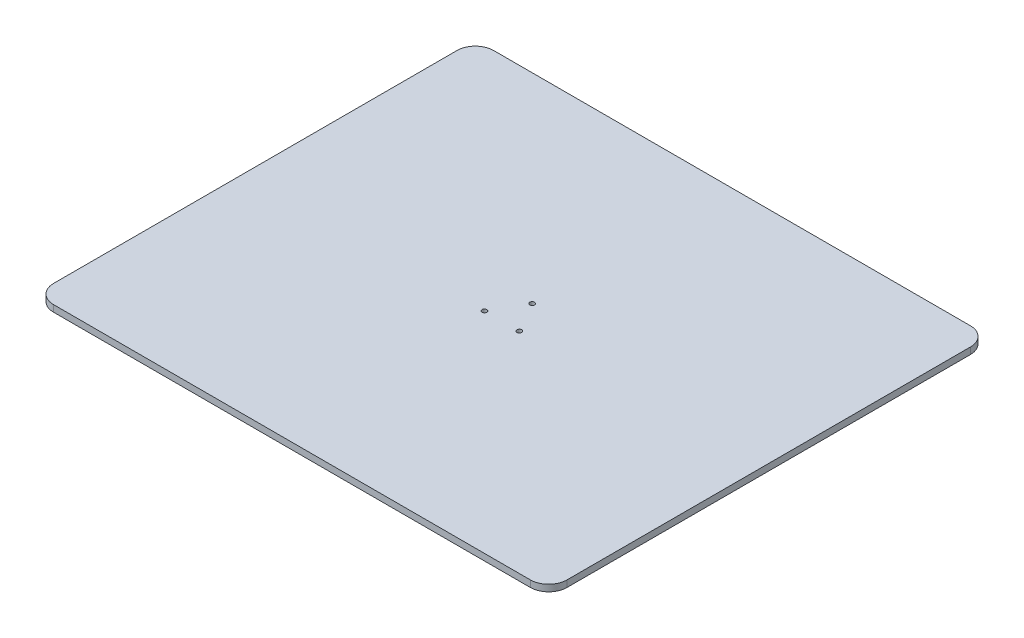
ISO-10303-21;
HEADER;
FILE_DESCRIPTION(('STEP AP214'),'2;1');
FILE_NAME('part.step','',(''),(''),'','','');
FILE_SCHEMA(('AUTOMOTIVE_DESIGN { 1 0 10303 214 1 1 1 1 }'));
ENDSEC;
DATA;
#1=APPLICATION_CONTEXT('core data for automotive mechanical design processes');
#2=APPLICATION_PROTOCOL_DEFINITION('international standard','automotive_design',2000,#1);
#3=PRODUCT_CONTEXT('',#1,'mechanical');
#4=PRODUCT('Part','Part','',(#3));
#5=PRODUCT_RELATED_PRODUCT_CATEGORY('part','',(#4));
#6=PRODUCT_DEFINITION_FORMATION('','',#4);
#7=PRODUCT_DEFINITION_CONTEXT('part definition',#1,'design');
#8=PRODUCT_DEFINITION('design','',#6,#7);
#9=PRODUCT_DEFINITION_SHAPE('','',#8);
#10=(LENGTH_UNIT() NAMED_UNIT(*) SI_UNIT(.MILLI.,.METRE.));
#11=(NAMED_UNIT(*) PLANE_ANGLE_UNIT() SI_UNIT($,.RADIAN.));
#12=(NAMED_UNIT(*) SI_UNIT($,.STERADIAN.) SOLID_ANGLE_UNIT());
#13=UNCERTAINTY_MEASURE_WITH_UNIT(LENGTH_MEASURE(1.E-05),#10,'distance_accuracy_value','');
#14=(GEOMETRIC_REPRESENTATION_CONTEXT(3) GLOBAL_UNCERTAINTY_ASSIGNED_CONTEXT((#13)) GLOBAL_UNIT_ASSIGNED_CONTEXT((#10,
#11,#12)) REPRESENTATION_CONTEXT('',''));
#15=CARTESIAN_POINT('',(0.,0.,0.));
#16=DIRECTION('',(0.,0.,1.));
#17=DIRECTION('',(1.,0.,0.));
#18=AXIS2_PLACEMENT_3D('',#15,#16,#17);
#19=CARTESIAN_POINT('',(1.38777878078145E-13,-6.,0.));
#20=DIRECTION('',(0.,1.,0.));
#21=DIRECTION('',(0.,0.,1.));
#22=AXIS2_PLACEMENT_3D('',#19,#20,#21);
#23=CYLINDRICAL_SURFACE('',#22,75.);
#24=CARTESIAN_POINT('',(1.38777878078145E-13,-6.,0.));
#25=DIRECTION('',(0.,-1.,0.));
#26=DIRECTION('',(0.,0.,-1.));
#27=AXIS2_PLACEMENT_3D('',#24,#25,#26);
#28=CIRCLE('',#27,75.);
#29=CARTESIAN_POINT('',(1.38777878078145E-13,-6.,-75.));
#30=VERTEX_POINT('',#29);
#31=EDGE_CURVE('E11',#30,#30,#28,.T.);
#32=ORIENTED_EDGE('',*,*,#31,.F.);
#33=EDGE_LOOP('',(#32));
#34=FACE_BOUND('',#33,.T.);
#35=CARTESIAN_POINT('',(1.38777878078145E-13,0.,0.));
#36=DIRECTION('',(0.,-1.,0.));
#37=DIRECTION('',(0.,0.,-1.));
#38=AXIS2_PLACEMENT_3D('',#35,#36,#37);
#39=CIRCLE('',#38,75.);
#40=CARTESIAN_POINT('',(1.38777878078145E-13,0.,-75.));
#41=VERTEX_POINT('',#40);
#42=EDGE_CURVE('E48',#41,#41,#39,.T.);
#43=ORIENTED_EDGE('',*,*,#42,.T.);
#44=EDGE_LOOP('',(#43));
#45=FACE_BOUND('',#44,.T.);
#46=ADVANCED_FACE('F45',(#34,#45),#23,.T.);
#47=CARTESIAN_POINT('',(1.38777878078145E-13,-6.,0.));
#48=DIRECTION('',(0.,-1.,0.));
#49=DIRECTION('',(0.,0.,-1.));
#50=AXIS2_PLACEMENT_3D('',#47,#48,#49);
#51=PLANE('',#50);
#52=ORIENTED_EDGE('',*,*,#31,.T.);
#53=EDGE_LOOP('',(#52));
#54=FACE_BOUND('',#53,.T.);
#55=ADVANCED_FACE('F60',(#54),#51,.T.);
#56=CARTESIAN_POINT('',(1.38777878078145E-13,0.,0.));
#57=DIRECTION('',(0.,-1.,0.));
#58=DIRECTION('',(0.,0.,-1.));
#59=AXIS2_PLACEMENT_3D('',#56,#57,#58);
#60=PLANE('',#59);
#61=ORIENTED_EDGE('',*,*,#42,.F.);
#62=EDGE_LOOP('',(#61));
#63=FACE_BOUND('',#62,.T.);
#64=ADVANCED_FACE('F58',(#63),#60,.F.);
#65=CLOSED_SHELL('',(#46,#55,#64));
#66=MANIFOLD_SOLID_BREP('B2',#65);
#67=CARTESIAN_POINT('',(0.,18.,0.));
#68=DIRECTION('',(0.,1.,0.));
#69=DIRECTION('',(0.,0.,1.));
#70=AXIS2_PLACEMENT_3D('',#67,#68,#69);
#71=PLANE('',#70);
#72=CARTESIAN_POINT('',(-47.6313972081446,18.,27.5000000000033));
#73=DIRECTION('',(0.,1.,0.));
#74=DIRECTION('',(0.,0.,1.));
#75=AXIS2_PLACEMENT_3D('',#72,#73,#74);
#76=CIRCLE('',#75,6.49999999999991);
#77=CARTESIAN_POINT('',(-47.6313972081446,18.,34.0000000000032));
#78=VERTEX_POINT('',#77);
#79=EDGE_CURVE('E233',#78,#78,#76,.T.);
#80=ORIENTED_EDGE('',*,*,#79,.F.);
#81=EDGE_LOOP('',(#80));
#82=FACE_BOUND('',#81,.T.);
#83=DIRECTION('',(0.,0.,-1.));
#84=VECTOR('',#83,1.);
#85=CARTESIAN_POINT('',(700.,18.,-600.));
#86=LINE('',#85,#84);
#87=CARTESIAN_POINT('',(700.,18.,550.));
#88=VERTEX_POINT('',#87);
#89=CARTESIAN_POINT('',(700.,18.,-550.));
#90=VERTEX_POINT('',#89);
#91=EDGE_CURVE('E190',#88,#90,#86,.T.);
#92=ORIENTED_EDGE('',*,*,#91,.T.);
#93=CARTESIAN_POINT('',(650.,18.,-550.));
#94=DIRECTION('',(0.,1.,0.));
#95=DIRECTION('',(0.,0.,1.));
#96=AXIS2_PLACEMENT_3D('',#93,#94,#95);
#97=CIRCLE('',#96,50.);
#98=CARTESIAN_POINT('',(650.,18.,-600.));
#99=VERTEX_POINT('',#98);
#100=EDGE_CURVE('E205',#90,#99,#97,.T.);
#101=ORIENTED_EDGE('',*,*,#100,.T.);
#102=DIRECTION('',(-1.,0.,0.));
#103=VECTOR('',#102,1.);
#104=CARTESIAN_POINT('',(-700.,18.,-600.));
#105=LINE('',#104,#103);
#106=CARTESIAN_POINT('',(-650.,18.,-600.));
#107=VERTEX_POINT('',#106);
#108=EDGE_CURVE('E172',#99,#107,#105,.T.);
#109=ORIENTED_EDGE('',*,*,#108,.T.);
#110=CARTESIAN_POINT('',(-650.,18.,-550.));
#111=DIRECTION('',(0.,1.,0.));
#112=DIRECTION('',(0.,0.,1.));
#113=AXIS2_PLACEMENT_3D('',#110,#111,#112);
#114=CIRCLE('',#113,50.);
#115=CARTESIAN_POINT('',(-700.,18.,-550.));
#116=VERTEX_POINT('',#115);
#117=EDGE_CURVE('E200',#107,#116,#114,.T.);
#118=ORIENTED_EDGE('',*,*,#117,.T.);
#119=DIRECTION('',(0.,0.,1.));
#120=VECTOR('',#119,1.);
#121=CARTESIAN_POINT('',(-700.,18.,-600.));
#122=LINE('',#121,#120);
#123=CARTESIAN_POINT('',(-700.,18.,550.));
#124=VERTEX_POINT('',#123);
#125=EDGE_CURVE('E216',#116,#124,#122,.T.);
#126=ORIENTED_EDGE('',*,*,#125,.T.);
#127=CARTESIAN_POINT('',(-650.,18.,550.));
#128=DIRECTION('',(0.,1.,0.));
#129=DIRECTION('',(0.,0.,1.));
#130=AXIS2_PLACEMENT_3D('',#127,#128,#129);
#131=CIRCLE('',#130,50.);
#132=CARTESIAN_POINT('',(-650.,18.,600.));
#133=VERTEX_POINT('',#132);
#134=EDGE_CURVE('E108',#124,#133,#131,.T.);
#135=ORIENTED_EDGE('',*,*,#134,.T.);
#136=DIRECTION('',(1.,0.,0.));
#137=VECTOR('',#136,1.);
#138=CARTESIAN_POINT('',(-700.,18.,600.));
#139=LINE('',#138,#137);
#140=CARTESIAN_POINT('',(650.,18.,600.));
#141=VERTEX_POINT('',#140);
#142=EDGE_CURVE('E191',#133,#141,#139,.T.);
#143=ORIENTED_EDGE('',*,*,#142,.T.);
#144=CARTESIAN_POINT('',(650.,18.,550.));
#145=DIRECTION('',(0.,1.,0.));
#146=DIRECTION('',(0.,0.,1.));
#147=AXIS2_PLACEMENT_3D('',#144,#145,#146);
#148=CIRCLE('',#147,50.);
#149=EDGE_CURVE('E203',#141,#88,#148,.T.);
#150=ORIENTED_EDGE('',*,*,#149,.T.);
#151=EDGE_LOOP('',(#92,#101,#109,#118,#126,#135,#143,#150));
#152=FACE_BOUND('',#151,.T.);
#153=CARTESIAN_POINT('',(-7.68125894545489E-13,18.,-55.));
#154=DIRECTION('',(0.,1.,0.));
#155=DIRECTION('',(0.,0.,1.));
#156=AXIS2_PLACEMENT_3D('',#153,#154,#155);
#157=CIRCLE('',#156,6.49999999999991);
#158=CARTESIAN_POINT('',(-7.68125894545489E-13,18.,-48.5000000000001));
#159=VERTEX_POINT('',#158);
#160=EDGE_CURVE('E185',#159,#159,#157,.T.);
#161=ORIENTED_EDGE('',*,*,#160,.F.);
#162=EDGE_LOOP('',(#161));
#163=FACE_BOUND('',#162,.T.);
#164=CARTESIAN_POINT('',(47.6313972081454,18.,27.5000000000013));
#165=DIRECTION('',(0.,1.,0.));
#166=DIRECTION('',(0.,0.,1.));
#167=AXIS2_PLACEMENT_3D('',#164,#165,#166);
#168=CIRCLE('',#167,6.50000000000033);
#169=CARTESIAN_POINT('',(47.6313972081454,18.,34.0000000000017));
#170=VERTEX_POINT('',#169);
#171=EDGE_CURVE('E239',#170,#170,#168,.T.);
#172=ORIENTED_EDGE('',*,*,#171,.F.);
#173=EDGE_LOOP('',(#172));
#174=FACE_BOUND('',#173,.T.);
#175=ADVANCED_FACE('F86',(#82,#152,#163,#174),#71,.T.);
#176=CARTESIAN_POINT('',(0.,0.,0.));
#177=DIRECTION('',(0.,1.,0.));
#178=DIRECTION('',(0.,0.,1.));
#179=AXIS2_PLACEMENT_3D('',#176,#177,#178);
#180=PLANE('',#179);
#181=CARTESIAN_POINT('',(0.,0.,0.));
#182=DIRECTION('',(0.,-1.,0.));
#183=DIRECTION('',(0.,0.,-1.));
#184=AXIS2_PLACEMENT_3D('',#181,#182,#183);
#185=CIRCLE('',#184,5.);
#186=CARTESIAN_POINT('',(0.,0.,-5.));
#187=VERTEX_POINT('',#186);
#188=EDGE_CURVE('E248',#187,#187,#185,.T.);
#189=ORIENTED_EDGE('',*,*,#188,.F.);
#190=EDGE_LOOP('',(#189));
#191=FACE_BOUND('',#190,.T.);
#192=DIRECTION('',(-1.,0.,0.));
#193=VECTOR('',#192,1.);
#194=CARTESIAN_POINT('',(-700.,0.,-600.));
#195=LINE('',#194,#193);
#196=CARTESIAN_POINT('',(650.,0.,-600.));
#197=VERTEX_POINT('',#196);
#198=CARTESIAN_POINT('',(-650.,0.,-600.));
#199=VERTEX_POINT('',#198);
#200=EDGE_CURVE('E169',#197,#199,#195,.T.);
#201=ORIENTED_EDGE('',*,*,#200,.F.);
#202=CARTESIAN_POINT('',(650.,0.,-550.));
#203=DIRECTION('',(0.,1.,0.));
#204=DIRECTION('',(0.,0.,1.));
#205=AXIS2_PLACEMENT_3D('',#202,#203,#204);
#206=CIRCLE('',#205,50.);
#207=CARTESIAN_POINT('',(700.,0.,-550.));
#208=VERTEX_POINT('',#207);
#209=EDGE_CURVE('E152',#197,#208,#206,.F.);
#210=ORIENTED_EDGE('',*,*,#209,.T.);
#211=DIRECTION('',(0.,0.,-1.));
#212=VECTOR('',#211,1.);
#213=CARTESIAN_POINT('',(700.,0.,-600.));
#214=LINE('',#213,#212);
#215=CARTESIAN_POINT('',(700.,0.,550.));
#216=VERTEX_POINT('',#215);
#217=EDGE_CURVE('E180',#216,#208,#214,.T.);
#218=ORIENTED_EDGE('',*,*,#217,.F.);
#219=CARTESIAN_POINT('',(650.,0.,550.));
#220=DIRECTION('',(0.,1.,0.));
#221=DIRECTION('',(0.,0.,1.));
#222=AXIS2_PLACEMENT_3D('',#219,#220,#221);
#223=CIRCLE('',#222,50.);
#224=CARTESIAN_POINT('',(650.,0.,600.));
#225=VERTEX_POINT('',#224);
#226=EDGE_CURVE('E163',#216,#225,#223,.F.);
#227=ORIENTED_EDGE('',*,*,#226,.T.);
#228=DIRECTION('',(1.,0.,0.));
#229=VECTOR('',#228,1.);
#230=CARTESIAN_POINT('',(-700.,0.,600.));
#231=LINE('',#230,#229);
#232=CARTESIAN_POINT('',(-650.,0.,600.));
#233=VERTEX_POINT('',#232);
#234=EDGE_CURVE('E183',#233,#225,#231,.T.);
#235=ORIENTED_EDGE('',*,*,#234,.F.);
#236=CARTESIAN_POINT('',(-650.,0.,550.));
#237=DIRECTION('',(0.,1.,0.));
#238=DIRECTION('',(0.,0.,1.));
#239=AXIS2_PLACEMENT_3D('',#236,#237,#238);
#240=CIRCLE('',#239,50.);
#241=CARTESIAN_POINT('',(-700.,0.,550.));
#242=VERTEX_POINT('',#241);
#243=EDGE_CURVE('E194',#233,#242,#240,.F.);
#244=ORIENTED_EDGE('',*,*,#243,.T.);
#245=DIRECTION('',(0.,0.,1.));
#246=VECTOR('',#245,1.);
#247=CARTESIAN_POINT('',(-700.,0.,-600.));
#248=LINE('',#247,#246);
#249=CARTESIAN_POINT('',(-700.,0.,-550.));
#250=VERTEX_POINT('',#249);
#251=EDGE_CURVE('E179',#250,#242,#248,.T.);
#252=ORIENTED_EDGE('',*,*,#251,.F.);
#253=CARTESIAN_POINT('',(-650.,0.,-550.));
#254=DIRECTION('',(0.,1.,0.));
#255=DIRECTION('',(0.,0.,1.));
#256=AXIS2_PLACEMENT_3D('',#253,#254,#255);
#257=CIRCLE('',#256,50.);
#258=EDGE_CURVE('E173',#250,#199,#257,.F.);
#259=ORIENTED_EDGE('',*,*,#258,.T.);
#260=EDGE_LOOP('',(#201,#210,#218,#227,#235,#244,#252,#259));
#261=FACE_BOUND('',#260,.T.);
#262=CARTESIAN_POINT('',(-7.68125894545489E-13,0.,-55.));
#263=DIRECTION('',(0.,1.,0.));
#264=DIRECTION('',(0.,0.,1.));
#265=AXIS2_PLACEMENT_3D('',#262,#263,#264);
#266=CIRCLE('',#265,6.49999999999991);
#267=CARTESIAN_POINT('',(-7.68125894545489E-13,0.,-48.5000000000001));
#268=VERTEX_POINT('',#267);
#269=EDGE_CURVE('E230',#268,#268,#266,.T.);
#270=ORIENTED_EDGE('',*,*,#269,.T.);
#271=EDGE_LOOP('',(#270));
#272=FACE_BOUND('',#271,.T.);
#273=CARTESIAN_POINT('',(-47.6313972081446,0.,27.5000000000033));
#274=DIRECTION('',(0.,1.,0.));
#275=DIRECTION('',(0.,0.,1.));
#276=AXIS2_PLACEMENT_3D('',#273,#274,#275);
#277=CIRCLE('',#276,6.49999999999991);
#278=CARTESIAN_POINT('',(-47.6313972081446,0.,34.0000000000032));
#279=VERTEX_POINT('',#278);
#280=EDGE_CURVE('E236',#279,#279,#277,.T.);
#281=ORIENTED_EDGE('',*,*,#280,.T.);
#282=EDGE_LOOP('',(#281));
#283=FACE_BOUND('',#282,.T.);
#284=CARTESIAN_POINT('',(47.6313972081454,0.,27.5000000000013));
#285=DIRECTION('',(0.,1.,0.));
#286=DIRECTION('',(0.,0.,1.));
#287=AXIS2_PLACEMENT_3D('',#284,#285,#286);
#288=CIRCLE('',#287,6.50000000000033);
#289=CARTESIAN_POINT('',(47.6313972081454,0.,34.0000000000017));
#290=VERTEX_POINT('',#289);
#291=EDGE_CURVE('E242',#290,#290,#288,.T.);
#292=ORIENTED_EDGE('',*,*,#291,.T.);
#293=EDGE_LOOP('',(#292));
#294=FACE_BOUND('',#293,.T.);
#295=ADVANCED_FACE('F176',(#191,#261,#272,#283,#294),#180,.F.);
#296=CARTESIAN_POINT('',(700.,18.,-600.));
#297=DIRECTION('',(-1.,0.,0.));
#298=DIRECTION('',(0.,0.,1.));
#299=AXIS2_PLACEMENT_3D('',#296,#297,#298);
#300=PLANE('',#299);
#301=ORIENTED_EDGE('',*,*,#217,.T.);
#302=DIRECTION('',(0.,-1.,0.));
#303=VECTOR('',#302,1.);
#304=CARTESIAN_POINT('',(700.,18.,-550.));
#305=LINE('',#304,#303);
#306=EDGE_CURVE('E157',#208,#90,#305,.F.);
#307=ORIENTED_EDGE('',*,*,#306,.T.);
#308=ORIENTED_EDGE('',*,*,#91,.F.);
#309=DIRECTION('',(0.,-1.,0.));
#310=VECTOR('',#309,1.);
#311=CARTESIAN_POINT('',(700.,18.,550.));
#312=LINE('',#311,#310);
#313=EDGE_CURVE('E162',#88,#216,#312,.T.);
#314=ORIENTED_EDGE('',*,*,#313,.T.);
#315=EDGE_LOOP('',(#301,#307,#308,#314));
#316=FACE_BOUND('',#315,.T.);
#317=ADVANCED_FACE('F264',(#316),#300,.F.);
#318=CARTESIAN_POINT('',(-700.,18.,-600.));
#319=DIRECTION('',(0.,0.,1.));
#320=DIRECTION('',(1.,0.,0.));
#321=AXIS2_PLACEMENT_3D('',#318,#319,#320);
#322=PLANE('',#321);
#323=ORIENTED_EDGE('',*,*,#108,.F.);
#324=DIRECTION('',(0.,-1.,0.));
#325=VECTOR('',#324,1.);
#326=CARTESIAN_POINT('',(650.,18.,-600.));
#327=LINE('',#326,#325);
#328=EDGE_CURVE('E156',#99,#197,#327,.T.);
#329=ORIENTED_EDGE('',*,*,#328,.T.);
#330=ORIENTED_EDGE('',*,*,#200,.T.);
#331=DIRECTION('',(0.,-1.,0.));
#332=VECTOR('',#331,1.);
#333=CARTESIAN_POINT('',(-650.,18.,-600.));
#334=LINE('',#333,#332);
#335=EDGE_CURVE('E174',#199,#107,#334,.F.);
#336=ORIENTED_EDGE('',*,*,#335,.T.);
#337=EDGE_LOOP('',(#323,#329,#330,#336));
#338=FACE_BOUND('',#337,.T.);
#339=ADVANCED_FACE('F168',(#338),#322,.F.);
#340=CARTESIAN_POINT('',(-700.,18.,-600.));
#341=DIRECTION('',(1.,0.,0.));
#342=DIRECTION('',(0.,0.,-1.));
#343=AXIS2_PLACEMENT_3D('',#340,#341,#342);
#344=PLANE('',#343);
#345=ORIENTED_EDGE('',*,*,#251,.T.);
#346=DIRECTION('',(0.,-1.,0.));
#347=VECTOR('',#346,1.);
#348=CARTESIAN_POINT('',(-700.,18.,550.));
#349=LINE('',#348,#347);
#350=EDGE_CURVE('E43',#242,#124,#349,.F.);
#351=ORIENTED_EDGE('',*,*,#350,.T.);
#352=ORIENTED_EDGE('',*,*,#125,.F.);
#353=DIRECTION('',(0.,-1.,0.));
#354=VECTOR('',#353,1.);
#355=CARTESIAN_POINT('',(-700.,18.,-550.));
#356=LINE('',#355,#354);
#357=EDGE_CURVE('E94',#116,#250,#356,.T.);
#358=ORIENTED_EDGE('',*,*,#357,.T.);
#359=EDGE_LOOP('',(#345,#351,#352,#358));
#360=FACE_BOUND('',#359,.T.);
#361=ADVANCED_FACE('F214',(#360),#344,.F.);
#362=CARTESIAN_POINT('',(-700.,18.,600.));
#363=DIRECTION('',(0.,0.,-1.));
#364=DIRECTION('',(-1.,0.,0.));
#365=AXIS2_PLACEMENT_3D('',#362,#363,#364);
#366=PLANE('',#365);
#367=ORIENTED_EDGE('',*,*,#234,.T.);
#368=DIRECTION('',(0.,-1.,0.));
#369=VECTOR('',#368,1.);
#370=CARTESIAN_POINT('',(650.,18.,600.));
#371=LINE('',#370,#369);
#372=EDGE_CURVE('E101',#225,#141,#371,.F.);
#373=ORIENTED_EDGE('',*,*,#372,.T.);
#374=ORIENTED_EDGE('',*,*,#142,.F.);
#375=DIRECTION('',(0.,-1.,0.));
#376=VECTOR('',#375,1.);
#377=CARTESIAN_POINT('',(-650.,18.,600.));
#378=LINE('',#377,#376);
#379=EDGE_CURVE('E207',#133,#233,#378,.T.);
#380=ORIENTED_EDGE('',*,*,#379,.T.);
#381=EDGE_LOOP('',(#367,#373,#374,#380));
#382=FACE_BOUND('',#381,.T.);
#383=ADVANCED_FACE('F223',(#382),#366,.F.);
#384=CARTESIAN_POINT('',(-7.68125894545489E-13,18.,-55.));
#385=DIRECTION('',(0.,-1.,0.));
#386=DIRECTION('',(0.,0.,-1.));
#387=AXIS2_PLACEMENT_3D('',#384,#385,#386);
#388=CYLINDRICAL_SURFACE('',#387,6.49999999999991);
#389=ORIENTED_EDGE('',*,*,#160,.T.);
#390=EDGE_LOOP('',(#389));
#391=FACE_BOUND('',#390,.T.);
#392=ORIENTED_EDGE('',*,*,#269,.F.);
#393=EDGE_LOOP('',(#392));
#394=FACE_BOUND('',#393,.T.);
#395=ADVANCED_FACE('F278',(#391,#394),#388,.F.);
#396=CARTESIAN_POINT('',(-47.6313972081446,18.,27.5000000000033));
#397=DIRECTION('',(0.,-1.,0.));
#398=DIRECTION('',(0.,0.,-1.));
#399=AXIS2_PLACEMENT_3D('',#396,#397,#398);
#400=CYLINDRICAL_SURFACE('',#399,6.49999999999991);
#401=ORIENTED_EDGE('',*,*,#79,.T.);
#402=EDGE_LOOP('',(#401));
#403=FACE_BOUND('',#402,.T.);
#404=ORIENTED_EDGE('',*,*,#280,.F.);
#405=EDGE_LOOP('',(#404));
#406=FACE_BOUND('',#405,.T.);
#407=ADVANCED_FACE('F303',(#403,#406),#400,.F.);
#408=CARTESIAN_POINT('',(47.6313972081454,18.,27.5000000000013));
#409=DIRECTION('',(0.,-1.,0.));
#410=DIRECTION('',(0.,0.,-1.));
#411=AXIS2_PLACEMENT_3D('',#408,#409,#410);
#412=CYLINDRICAL_SURFACE('',#411,6.50000000000033);
#413=ORIENTED_EDGE('',*,*,#171,.T.);
#414=EDGE_LOOP('',(#413));
#415=FACE_BOUND('',#414,.T.);
#416=ORIENTED_EDGE('',*,*,#291,.F.);
#417=EDGE_LOOP('',(#416));
#418=FACE_BOUND('',#417,.T.);
#419=ADVANCED_FACE('F259',(#415,#418),#412,.F.);
#420=CARTESIAN_POINT('',(0.,1.,0.));
#421=DIRECTION('',(0.,-1.,0.));
#422=DIRECTION('',(0.,0.,-1.));
#423=AXIS2_PLACEMENT_3D('',#420,#421,#422);
#424=CYLINDRICAL_SURFACE('',#423,5.);
#425=CARTESIAN_POINT('',(0.,1.,0.));
#426=DIRECTION('',(0.,-1.,0.));
#427=DIRECTION('',(0.,0.,-1.));
#428=AXIS2_PLACEMENT_3D('',#425,#426,#427);
#429=CIRCLE('',#428,5.);
#430=CARTESIAN_POINT('',(0.,1.,-5.));
#431=VERTEX_POINT('',#430);
#432=EDGE_CURVE('E245',#431,#431,#429,.T.);
#433=ORIENTED_EDGE('',*,*,#432,.F.);
#434=EDGE_LOOP('',(#433));
#435=FACE_BOUND('',#434,.T.);
#436=ORIENTED_EDGE('',*,*,#188,.T.);
#437=EDGE_LOOP('',(#436));
#438=FACE_BOUND('',#437,.T.);
#439=ADVANCED_FACE('F256',(#435,#438),#424,.F.);
#440=CARTESIAN_POINT('',(0.,1.,0.));
#441=DIRECTION('',(0.,-1.,0.));
#442=DIRECTION('',(0.,0.,-1.));
#443=AXIS2_PLACEMENT_3D('',#440,#441,#442);
#444=PLANE('',#443);
#445=ORIENTED_EDGE('',*,*,#432,.T.);
#446=EDGE_LOOP('',(#445));
#447=FACE_BOUND('',#446,.T.);
#448=ADVANCED_FACE('F254',(#447),#444,.T.);
#449=CARTESIAN_POINT('',(650.,18.,-550.));
#450=DIRECTION('',(0.,-1.,0.));
#451=DIRECTION('',(0.,0.,-1.));
#452=AXIS2_PLACEMENT_3D('',#449,#450,#451);
#453=CYLINDRICAL_SURFACE('',#452,50.);
#454=ORIENTED_EDGE('',*,*,#100,.F.);
#455=ORIENTED_EDGE('',*,*,#306,.F.);
#456=ORIENTED_EDGE('',*,*,#209,.F.);
#457=ORIENTED_EDGE('',*,*,#328,.F.);
#458=EDGE_LOOP('',(#454,#455,#456,#457));
#459=FACE_BOUND('',#458,.T.);
#460=ADVANCED_FACE('F155',(#459),#453,.T.);
#461=CARTESIAN_POINT('',(650.,18.,550.));
#462=DIRECTION('',(0.,-1.,0.));
#463=DIRECTION('',(0.,0.,-1.));
#464=AXIS2_PLACEMENT_3D('',#461,#462,#463);
#465=CYLINDRICAL_SURFACE('',#464,50.);
#466=ORIENTED_EDGE('',*,*,#149,.F.);
#467=ORIENTED_EDGE('',*,*,#372,.F.);
#468=ORIENTED_EDGE('',*,*,#226,.F.);
#469=ORIENTED_EDGE('',*,*,#313,.F.);
#470=EDGE_LOOP('',(#466,#467,#468,#469));
#471=FACE_BOUND('',#470,.T.);
#472=ADVANCED_FACE('F285',(#471),#465,.T.);
#473=CARTESIAN_POINT('',(-650.,18.,550.));
#474=DIRECTION('',(0.,-1.,0.));
#475=DIRECTION('',(0.,0.,-1.));
#476=AXIS2_PLACEMENT_3D('',#473,#474,#475);
#477=CYLINDRICAL_SURFACE('',#476,50.);
#478=ORIENTED_EDGE('',*,*,#134,.F.);
#479=ORIENTED_EDGE('',*,*,#350,.F.);
#480=ORIENTED_EDGE('',*,*,#243,.F.);
#481=ORIENTED_EDGE('',*,*,#379,.F.);
#482=EDGE_LOOP('',(#478,#479,#480,#481));
#483=FACE_BOUND('',#482,.T.);
#484=ADVANCED_FACE('F222',(#483),#477,.T.);
#485=CARTESIAN_POINT('',(-650.,18.,-550.));
#486=DIRECTION('',(0.,-1.,0.));
#487=DIRECTION('',(0.,0.,-1.));
#488=AXIS2_PLACEMENT_3D('',#485,#486,#487);
#489=CYLINDRICAL_SURFACE('',#488,50.);
#490=ORIENTED_EDGE('',*,*,#117,.F.);
#491=ORIENTED_EDGE('',*,*,#335,.F.);
#492=ORIENTED_EDGE('',*,*,#258,.F.);
#493=ORIENTED_EDGE('',*,*,#357,.F.);
#494=EDGE_LOOP('',(#490,#491,#492,#493));
#495=FACE_BOUND('',#494,.T.);
#496=ADVANCED_FACE('F88',(#495),#489,.T.);
#497=CLOSED_SHELL('',(#175,#295,#317,#339,#361,#383,#395,#407,#419,#439,#448,#460,#472,#484,#496));
#498=MANIFOLD_SOLID_BREP('B6',#497);
#499=ADVANCED_BREP_SHAPE_REPRESENTATION('',(#18,#66,#498),#14);
#500=SHAPE_DEFINITION_REPRESENTATION(#9,#499);
ENDSEC;
END-ISO-10303-21;
